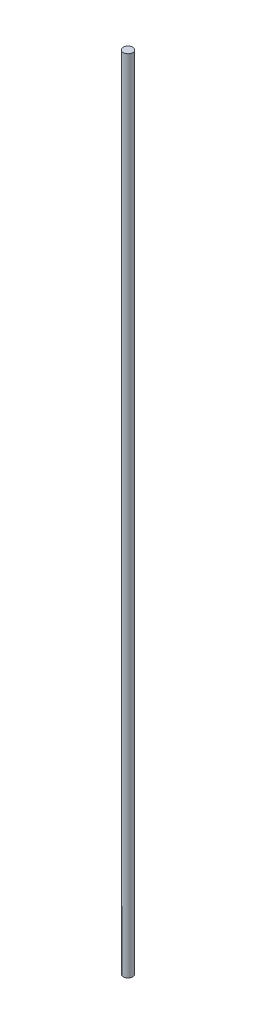
ISO-10303-21;
HEADER;
FILE_DESCRIPTION(('STEP AP214'),'2;1');
FILE_NAME('part.step','',(''),(''),'','','');
FILE_SCHEMA(('AUTOMOTIVE_DESIGN { 1 0 10303 214 1 1 1 1 }'));
ENDSEC;
DATA;
#1=APPLICATION_CONTEXT('core data for automotive mechanical design processes');
#2=APPLICATION_PROTOCOL_DEFINITION('international standard','automotive_design',2000,#1);
#3=PRODUCT_CONTEXT('',#1,'mechanical');
#4=PRODUCT('Part','Part','',(#3));
#5=PRODUCT_RELATED_PRODUCT_CATEGORY('part','',(#4));
#6=PRODUCT_DEFINITION_FORMATION('','',#4);
#7=PRODUCT_DEFINITION_CONTEXT('part definition',#1,'design');
#8=PRODUCT_DEFINITION('design','',#6,#7);
#9=PRODUCT_DEFINITION_SHAPE('','',#8);
#10=(LENGTH_UNIT() NAMED_UNIT(*) SI_UNIT(.MILLI.,.METRE.));
#11=(NAMED_UNIT(*) PLANE_ANGLE_UNIT() SI_UNIT($,.RADIAN.));
#12=(NAMED_UNIT(*) SI_UNIT($,.STERADIAN.) SOLID_ANGLE_UNIT());
#13=UNCERTAINTY_MEASURE_WITH_UNIT(LENGTH_MEASURE(1.E-05),#10,'distance_accuracy_value','');
#14=(GEOMETRIC_REPRESENTATION_CONTEXT(3) GLOBAL_UNCERTAINTY_ASSIGNED_CONTEXT((#13)) GLOBAL_UNIT_ASSIGNED_CONTEXT((#10,
#11,#12)) REPRESENTATION_CONTEXT('',''));
#15=CARTESIAN_POINT('',(0.,0.,0.));
#16=DIRECTION('',(0.,0.,1.));
#17=DIRECTION('',(1.,0.,0.));
#18=AXIS2_PLACEMENT_3D('',#15,#16,#17);
#19=CARTESIAN_POINT('',(0.,420.,0.));
#20=DIRECTION('',(0.,-1.,0.));
#21=DIRECTION('',(0.,0.,-1.));
#22=AXIS2_PLACEMENT_3D('',#19,#20,#21);
#23=CYLINDRICAL_SURFACE('',#22,2.5);
#24=CARTESIAN_POINT('',(0.,420.,0.));
#25=DIRECTION('',(0.,1.,0.));
#26=DIRECTION('',(0.,0.,1.));
#27=AXIS2_PLACEMENT_3D('',#24,#25,#26);
#28=CIRCLE('',#27,2.5);
#29=CARTESIAN_POINT('',(0.,420.,2.5));
#30=VERTEX_POINT('',#29);
#31=EDGE_CURVE('E10',#30,#30,#28,.T.);
#32=ORIENTED_EDGE('',*,*,#31,.F.);
#33=EDGE_LOOP('',(#32));
#34=FACE_BOUND('',#33,.T.);
#35=CARTESIAN_POINT('',(0.,0.,0.));
#36=DIRECTION('',(0.,1.,0.));
#37=DIRECTION('',(0.,0.,1.));
#38=AXIS2_PLACEMENT_3D('',#35,#36,#37);
#39=CIRCLE('',#38,2.5);
#40=CARTESIAN_POINT('',(0.,0.,2.5));
#41=VERTEX_POINT('',#40);
#42=EDGE_CURVE('E40',#41,#41,#39,.T.);
#43=ORIENTED_EDGE('',*,*,#42,.T.);
#44=EDGE_LOOP('',(#43));
#45=FACE_BOUND('',#44,.T.);
#46=ADVANCED_FACE('F37',(#34,#45),#23,.T.);
#47=CARTESIAN_POINT('',(0.,420.,0.));
#48=DIRECTION('',(0.,1.,0.));
#49=DIRECTION('',(0.,0.,1.));
#50=AXIS2_PLACEMENT_3D('',#47,#48,#49);
#51=PLANE('',#50);
#52=ORIENTED_EDGE('',*,*,#31,.T.);
#53=EDGE_LOOP('',(#52));
#54=FACE_BOUND('',#53,.T.);
#55=ADVANCED_FACE('F54',(#54),#51,.T.);
#56=CARTESIAN_POINT('',(0.,0.,0.));
#57=DIRECTION('',(0.,1.,0.));
#58=DIRECTION('',(0.,0.,1.));
#59=AXIS2_PLACEMENT_3D('',#56,#57,#58);
#60=PLANE('',#59);
#61=ORIENTED_EDGE('',*,*,#42,.F.);
#62=EDGE_LOOP('',(#61));
#63=FACE_BOUND('',#62,.T.);
#64=ADVANCED_FACE('F52',(#63),#60,.F.);
#65=CLOSED_SHELL('',(#46,#55,#64));
#66=MANIFOLD_SOLID_BREP('B2',#65);
#67=ADVANCED_BREP_SHAPE_REPRESENTATION('',(#18,#66),#14);
#68=SHAPE_DEFINITION_REPRESENTATION(#9,#67);
ENDSEC;
END-ISO-10303-21;
